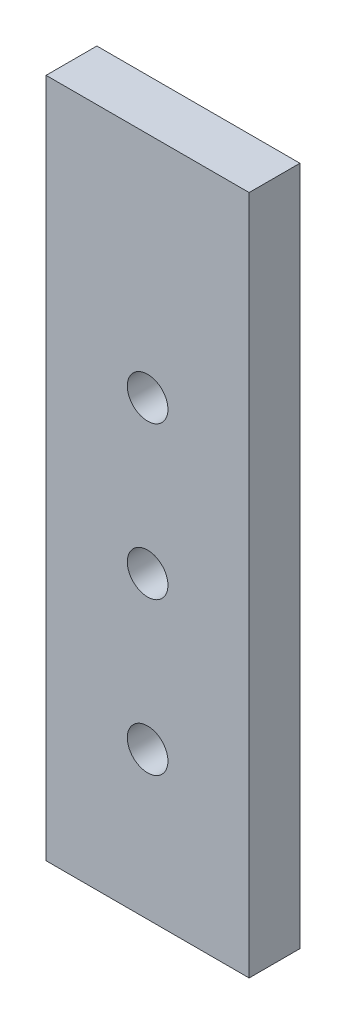
ISO-10303-21;
HEADER;
FILE_DESCRIPTION(('STEP AP214'),'2;1');
FILE_NAME('part.step','',(''),(''),'','','');
FILE_SCHEMA(('AUTOMOTIVE_DESIGN { 1 0 10303 214 1 1 1 1 }'));
ENDSEC;
DATA;
#1=APPLICATION_CONTEXT('core data for automotive mechanical design processes');
#2=APPLICATION_PROTOCOL_DEFINITION('international standard','automotive_design',2000,#1);
#3=PRODUCT_CONTEXT('',#1,'mechanical');
#4=PRODUCT('Part','Part','',(#3));
#5=PRODUCT_RELATED_PRODUCT_CATEGORY('part','',(#4));
#6=PRODUCT_DEFINITION_FORMATION('','',#4);
#7=PRODUCT_DEFINITION_CONTEXT('part definition',#1,'design');
#8=PRODUCT_DEFINITION('design','',#6,#7);
#9=PRODUCT_DEFINITION_SHAPE('','',#8);
#10=(LENGTH_UNIT() NAMED_UNIT(*) SI_UNIT(.MILLI.,.METRE.));
#11=(NAMED_UNIT(*) PLANE_ANGLE_UNIT() SI_UNIT($,.RADIAN.));
#12=(NAMED_UNIT(*) SI_UNIT($,.STERADIAN.) SOLID_ANGLE_UNIT());
#13=UNCERTAINTY_MEASURE_WITH_UNIT(LENGTH_MEASURE(1.E-05),#10,'distance_accuracy_value','');
#14=(GEOMETRIC_REPRESENTATION_CONTEXT(3) GLOBAL_UNCERTAINTY_ASSIGNED_CONTEXT((#13)) GLOBAL_UNIT_ASSIGNED_CONTEXT((#10,
#11,#12)) REPRESENTATION_CONTEXT('',''));
#15=CARTESIAN_POINT('',(0.,0.,0.));
#16=DIRECTION('',(0.,0.,1.));
#17=DIRECTION('',(1.,0.,0.));
#18=AXIS2_PLACEMENT_3D('',#15,#16,#17);
#19=CARTESIAN_POINT('',(10.,15.,5.));
#20=DIRECTION('',(-1.,0.,0.));
#21=DIRECTION('',(0.,-1.,0.));
#22=AXIS2_PLACEMENT_3D('',#19,#20,#21);
#23=PLANE('',#22);
#24=DIRECTION('',(0.,1.,0.));
#25=VECTOR('',#24,1.);
#26=CARTESIAN_POINT('',(10.,15.,0.));
#27=LINE('',#26,#25);
#28=CARTESIAN_POINT('',(10.,-22.,0.));
#29=VERTEX_POINT('',#28);
#30=CARTESIAN_POINT('',(10.,45.,0.));
#31=VERTEX_POINT('',#30);
#32=EDGE_CURVE('E52',#29,#31,#27,.T.);
#33=ORIENTED_EDGE('',*,*,#32,.T.);
#34=DIRECTION('',(0.,0.,-1.));
#35=VECTOR('',#34,1.);
#36=CARTESIAN_POINT('',(10.,45.,0.));
#37=LINE('',#36,#35);
#38=CARTESIAN_POINT('',(10.,45.,5.));
#39=VERTEX_POINT('',#38);
#40=EDGE_CURVE('E89',#39,#31,#37,.T.);
#41=ORIENTED_EDGE('',*,*,#40,.F.);
#42=DIRECTION('',(0.,1.,0.));
#43=VECTOR('',#42,1.);
#44=CARTESIAN_POINT('',(10.,15.,5.));
#45=LINE('',#44,#43);
#46=CARTESIAN_POINT('',(10.,-22.,5.));
#47=VERTEX_POINT('',#46);
#48=EDGE_CURVE('E44',#47,#39,#45,.T.);
#49=ORIENTED_EDGE('',*,*,#48,.F.);
#50=DIRECTION('',(0.,0.,1.));
#51=VECTOR('',#50,1.);
#52=CARTESIAN_POINT('',(10.,-22.,0.));
#53=LINE('',#52,#51);
#54=EDGE_CURVE('E103',#29,#47,#53,.T.);
#55=ORIENTED_EDGE('',*,*,#54,.F.);
#56=EDGE_LOOP('',(#33,#41,#49,#55));
#57=FACE_BOUND('',#56,.T.);
#58=ADVANCED_FACE('F36',(#57),#23,.F.);
#59=CARTESIAN_POINT('',(-10.,15.,5.));
#60=DIRECTION('',(1.,0.,0.));
#61=DIRECTION('',(0.,1.,0.));
#62=AXIS2_PLACEMENT_3D('',#59,#60,#61);
#63=PLANE('',#62);
#64=DIRECTION('',(0.,-1.,0.));
#65=VECTOR('',#64,1.);
#66=CARTESIAN_POINT('',(-10.,15.,0.));
#67=LINE('',#66,#65);
#68=CARTESIAN_POINT('',(-10.,45.,0.));
#69=VERTEX_POINT('',#68);
#70=CARTESIAN_POINT('',(-10.,-22.,0.));
#71=VERTEX_POINT('',#70);
#72=EDGE_CURVE('E39',#69,#71,#67,.T.);
#73=ORIENTED_EDGE('',*,*,#72,.T.);
#74=DIRECTION('',(0.,0.,-1.));
#75=VECTOR('',#74,1.);
#76=CARTESIAN_POINT('',(-10.,-22.,0.));
#77=LINE('',#76,#75);
#78=CARTESIAN_POINT('',(-10.,-22.,5.));
#79=VERTEX_POINT('',#78);
#80=EDGE_CURVE('E79',#79,#71,#77,.T.);
#81=ORIENTED_EDGE('',*,*,#80,.F.);
#82=DIRECTION('',(0.,-1.,0.));
#83=VECTOR('',#82,1.);
#84=CARTESIAN_POINT('',(-10.,15.,5.));
#85=LINE('',#84,#83);
#86=CARTESIAN_POINT('',(-10.,45.,5.));
#87=VERTEX_POINT('',#86);
#88=EDGE_CURVE('E11',#87,#79,#85,.T.);
#89=ORIENTED_EDGE('',*,*,#88,.F.);
#90=DIRECTION('',(0.,0.,1.));
#91=VECTOR('',#90,1.);
#92=CARTESIAN_POINT('',(-10.,45.,0.));
#93=LINE('',#92,#91);
#94=EDGE_CURVE('E78',#69,#87,#93,.T.);
#95=ORIENTED_EDGE('',*,*,#94,.F.);
#96=EDGE_LOOP('',(#73,#81,#89,#95));
#97=FACE_BOUND('',#96,.T.);
#98=ADVANCED_FACE('F76',(#97),#63,.F.);
#99=CARTESIAN_POINT('',(0.,0.,5.));
#100=DIRECTION('',(0.,0.,1.));
#101=DIRECTION('',(1.,0.,0.));
#102=AXIS2_PLACEMENT_3D('',#99,#100,#101);
#103=PLANE('',#102);
#104=CARTESIAN_POINT('',(0.,22.5,5.));
#105=DIRECTION('',(0.,0.,1.));
#106=DIRECTION('',(1.,0.,0.));
#107=AXIS2_PLACEMENT_3D('',#104,#105,#106);
#108=CIRCLE('',#107,2.);
#109=CARTESIAN_POINT('',(2.,22.5,5.));
#110=VERTEX_POINT('',#109);
#111=EDGE_CURVE('E94',#110,#110,#108,.T.);
#112=ORIENTED_EDGE('',*,*,#111,.F.);
#113=EDGE_LOOP('',(#112));
#114=FACE_BOUND('',#113,.T.);
#115=CARTESIAN_POINT('',(0.,7.5,5.));
#116=DIRECTION('',(0.,0.,1.));
#117=DIRECTION('',(1.,0.,0.));
#118=AXIS2_PLACEMENT_3D('',#115,#116,#117);
#119=CIRCLE('',#118,2.);
#120=CARTESIAN_POINT('',(2.,7.5,5.));
#121=VERTEX_POINT('',#120);
#122=EDGE_CURVE('E115',#121,#121,#119,.T.);
#123=ORIENTED_EDGE('',*,*,#122,.F.);
#124=EDGE_LOOP('',(#123));
#125=FACE_BOUND('',#124,.T.);
#126=CARTESIAN_POINT('',(0.,-7.5,5.));
#127=DIRECTION('',(0.,0.,1.));
#128=DIRECTION('',(1.,0.,0.));
#129=AXIS2_PLACEMENT_3D('',#126,#127,#128);
#130=CIRCLE('',#129,2.);
#131=CARTESIAN_POINT('',(2.,-7.5,5.));
#132=VERTEX_POINT('',#131);
#133=EDGE_CURVE('E111',#132,#132,#130,.T.);
#134=ORIENTED_EDGE('',*,*,#133,.F.);
#135=EDGE_LOOP('',(#134));
#136=FACE_BOUND('',#135,.T.);
#137=ORIENTED_EDGE('',*,*,#48,.T.);
#138=DIRECTION('',(1.,0.,0.));
#139=VECTOR('',#138,1.);
#140=CARTESIAN_POINT('',(-10.,45.,5.));
#141=LINE('',#140,#139);
#142=EDGE_CURVE('E84',#87,#39,#141,.T.);
#143=ORIENTED_EDGE('',*,*,#142,.F.);
#144=ORIENTED_EDGE('',*,*,#88,.T.);
#145=DIRECTION('',(-1.,0.,0.));
#146=VECTOR('',#145,1.);
#147=CARTESIAN_POINT('',(10.,-22.,5.));
#148=LINE('',#147,#146);
#149=EDGE_CURVE('E106',#47,#79,#148,.T.);
#150=ORIENTED_EDGE('',*,*,#149,.F.);
#151=EDGE_LOOP('',(#137,#143,#144,#150));
#152=FACE_BOUND('',#151,.T.);
#153=ADVANCED_FACE('F85',(#114,#125,#136,#152),#103,.T.);
#154=CARTESIAN_POINT('',(0.,0.,0.));
#155=DIRECTION('',(0.,0.,1.));
#156=DIRECTION('',(1.,0.,0.));
#157=AXIS2_PLACEMENT_3D('',#154,#155,#156);
#158=PLANE('',#157);
#159=CARTESIAN_POINT('',(0.,22.5,0.));
#160=DIRECTION('',(0.,0.,-1.));
#161=DIRECTION('',(-1.,0.,0.));
#162=AXIS2_PLACEMENT_3D('',#159,#160,#161);
#163=CIRCLE('',#162,2.);
#164=CARTESIAN_POINT('',(-2.,22.5,0.));
#165=VERTEX_POINT('',#164);
#166=EDGE_CURVE('E97',#165,#165,#163,.T.);
#167=ORIENTED_EDGE('',*,*,#166,.F.);
#168=EDGE_LOOP('',(#167));
#169=FACE_BOUND('',#168,.T.);
#170=CARTESIAN_POINT('',(0.,7.5,0.));
#171=DIRECTION('',(0.,0.,1.));
#172=DIRECTION('',(1.,0.,0.));
#173=AXIS2_PLACEMENT_3D('',#170,#171,#172);
#174=CIRCLE('',#173,2.);
#175=CARTESIAN_POINT('',(2.,7.5,0.));
#176=VERTEX_POINT('',#175);
#177=EDGE_CURVE('E112',#176,#176,#174,.T.);
#178=ORIENTED_EDGE('',*,*,#177,.T.);
#179=EDGE_LOOP('',(#178));
#180=FACE_BOUND('',#179,.T.);
#181=CARTESIAN_POINT('',(0.,-7.5,0.));
#182=DIRECTION('',(0.,0.,1.));
#183=DIRECTION('',(1.,0.,0.));
#184=AXIS2_PLACEMENT_3D('',#181,#182,#183);
#185=CIRCLE('',#184,2.);
#186=CARTESIAN_POINT('',(2.,-7.5,0.));
#187=VERTEX_POINT('',#186);
#188=EDGE_CURVE('E118',#187,#187,#185,.T.);
#189=ORIENTED_EDGE('',*,*,#188,.T.);
#190=EDGE_LOOP('',(#189));
#191=FACE_BOUND('',#190,.T.);
#192=ORIENTED_EDGE('',*,*,#32,.F.);
#193=DIRECTION('',(1.,0.,0.));
#194=VECTOR('',#193,1.);
#195=CARTESIAN_POINT('',(10.,-22.,0.));
#196=LINE('',#195,#194);
#197=EDGE_CURVE('E109',#71,#29,#196,.T.);
#198=ORIENTED_EDGE('',*,*,#197,.F.);
#199=ORIENTED_EDGE('',*,*,#72,.F.);
#200=DIRECTION('',(-1.,0.,0.));
#201=VECTOR('',#200,1.);
#202=CARTESIAN_POINT('',(-10.,45.,0.));
#203=LINE('',#202,#201);
#204=EDGE_CURVE('E93',#31,#69,#203,.T.);
#205=ORIENTED_EDGE('',*,*,#204,.F.);
#206=EDGE_LOOP('',(#192,#198,#199,#205));
#207=FACE_BOUND('',#206,.T.);
#208=ADVANCED_FACE('F125',(#169,#180,#191,#207),#158,.F.);
#209=CARTESIAN_POINT('',(0.,-7.5,0.));
#210=DIRECTION('',(0.,0.,1.));
#211=DIRECTION('',(1.,0.,0.));
#212=AXIS2_PLACEMENT_3D('',#209,#210,#211);
#213=CYLINDRICAL_SURFACE('',#212,2.);
#214=ORIENTED_EDGE('',*,*,#188,.F.);
#215=EDGE_LOOP('',(#214));
#216=FACE_BOUND('',#215,.T.);
#217=ORIENTED_EDGE('',*,*,#133,.T.);
#218=EDGE_LOOP('',(#217));
#219=FACE_BOUND('',#218,.T.);
#220=ADVANCED_FACE('F137',(#216,#219),#213,.F.);
#221=CARTESIAN_POINT('',(0.,7.5,0.));
#222=DIRECTION('',(0.,0.,1.));
#223=DIRECTION('',(1.,0.,0.));
#224=AXIS2_PLACEMENT_3D('',#221,#222,#223);
#225=CYLINDRICAL_SURFACE('',#224,2.);
#226=ORIENTED_EDGE('',*,*,#177,.F.);
#227=EDGE_LOOP('',(#226));
#228=FACE_BOUND('',#227,.T.);
#229=ORIENTED_EDGE('',*,*,#122,.T.);
#230=EDGE_LOOP('',(#229));
#231=FACE_BOUND('',#230,.T.);
#232=ADVANCED_FACE('F129',(#228,#231),#225,.F.);
#233=CARTESIAN_POINT('',(0.,-22.,0.));
#234=DIRECTION('',(0.,-1.,0.));
#235=DIRECTION('',(0.,0.,-1.));
#236=AXIS2_PLACEMENT_3D('',#233,#234,#235);
#237=PLANE('',#236);
#238=ORIENTED_EDGE('',*,*,#54,.T.);
#239=ORIENTED_EDGE('',*,*,#149,.T.);
#240=ORIENTED_EDGE('',*,*,#80,.T.);
#241=ORIENTED_EDGE('',*,*,#197,.T.);
#242=EDGE_LOOP('',(#238,#239,#240,#241));
#243=FACE_BOUND('',#242,.T.);
#244=ADVANCED_FACE('F127',(#243),#237,.T.);
#245=CARTESIAN_POINT('',(0.,45.,0.));
#246=DIRECTION('',(0.,1.,0.));
#247=DIRECTION('',(0.,0.,1.));
#248=AXIS2_PLACEMENT_3D('',#245,#246,#247);
#249=PLANE('',#248);
#250=ORIENTED_EDGE('',*,*,#94,.T.);
#251=ORIENTED_EDGE('',*,*,#142,.T.);
#252=ORIENTED_EDGE('',*,*,#40,.T.);
#253=ORIENTED_EDGE('',*,*,#204,.T.);
#254=EDGE_LOOP('',(#250,#251,#252,#253));
#255=FACE_BOUND('',#254,.T.);
#256=ADVANCED_FACE('F92',(#255),#249,.T.);
#257=CARTESIAN_POINT('',(0.,22.5,7.));
#258=DIRECTION('',(0.,0.,-1.));
#259=DIRECTION('',(-1.,0.,0.));
#260=AXIS2_PLACEMENT_3D('',#257,#258,#259);
#261=CYLINDRICAL_SURFACE('',#260,2.);
#262=ORIENTED_EDGE('',*,*,#111,.T.);
#263=EDGE_LOOP('',(#262));
#264=FACE_BOUND('',#263,.T.);
#265=ORIENTED_EDGE('',*,*,#166,.T.);
#266=EDGE_LOOP('',(#265));
#267=FACE_BOUND('',#266,.T.);
#268=ADVANCED_FACE('F135',(#264,#267),#261,.F.);
#269=CLOSED_SHELL('',(#58,#98,#153,#208,#220,#232,#244,#256,#268));
#270=MANIFOLD_SOLID_BREP('B2',#269);
#271=ADVANCED_BREP_SHAPE_REPRESENTATION('',(#18,#270),#14);
#272=SHAPE_DEFINITION_REPRESENTATION(#9,#271);
ENDSEC;
END-ISO-10303-21;
